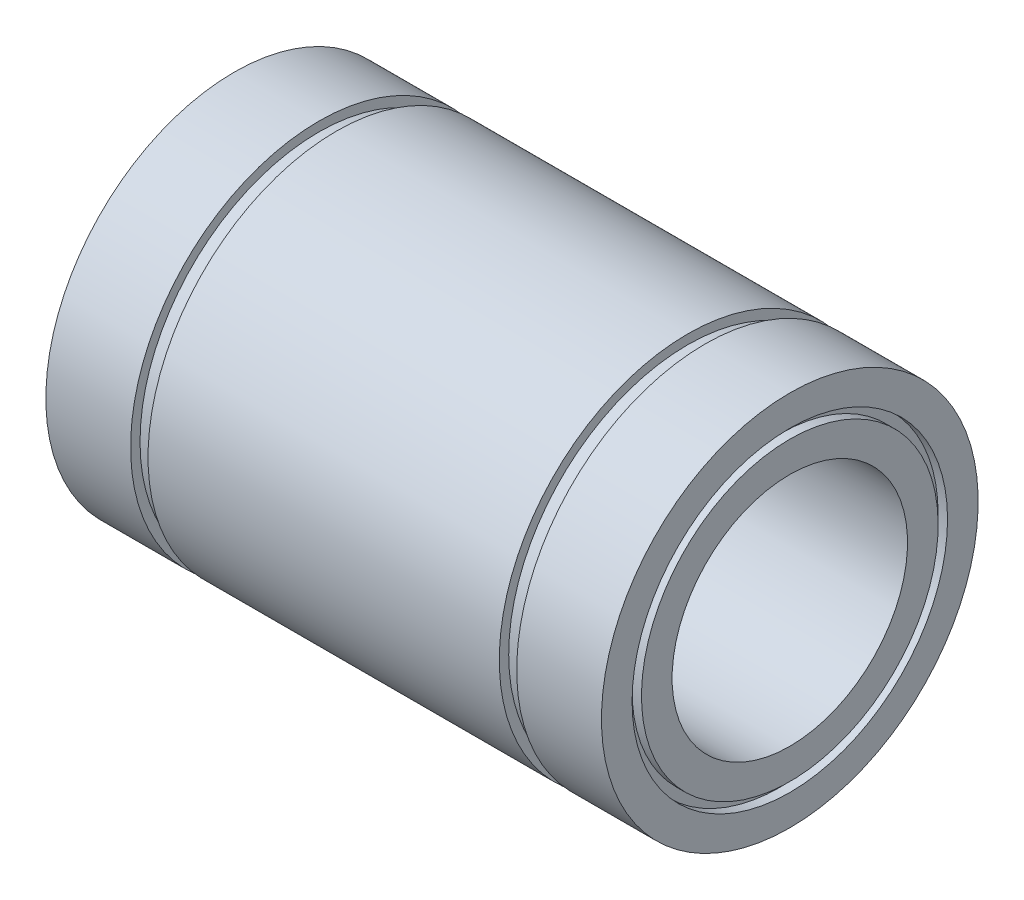
ISO-10303-21;
HEADER;
FILE_DESCRIPTION(('STEP AP214'),'2;1');
FILE_NAME('part.step','',(''),(''),'','','');
FILE_SCHEMA(('AUTOMOTIVE_DESIGN { 1 0 10303 214 1 1 1 1 }'));
ENDSEC;
DATA;
#1=APPLICATION_CONTEXT('core data for automotive mechanical design processes');
#2=APPLICATION_PROTOCOL_DEFINITION('international standard','automotive_design',2000,#1);
#3=PRODUCT_CONTEXT('',#1,'mechanical');
#4=PRODUCT('Part','Part','',(#3));
#5=PRODUCT_RELATED_PRODUCT_CATEGORY('part','',(#4));
#6=PRODUCT_DEFINITION_FORMATION('','',#4);
#7=PRODUCT_DEFINITION_CONTEXT('part definition',#1,'design');
#8=PRODUCT_DEFINITION('design','',#6,#7);
#9=PRODUCT_DEFINITION_SHAPE('','',#8);
#10=(LENGTH_UNIT() NAMED_UNIT(*) SI_UNIT(.MILLI.,.METRE.));
#11=(NAMED_UNIT(*) PLANE_ANGLE_UNIT() SI_UNIT($,.RADIAN.));
#12=(NAMED_UNIT(*) SI_UNIT($,.STERADIAN.) SOLID_ANGLE_UNIT());
#13=UNCERTAINTY_MEASURE_WITH_UNIT(LENGTH_MEASURE(1.E-05),#10,'distance_accuracy_value','');
#14=(GEOMETRIC_REPRESENTATION_CONTEXT(3) GLOBAL_UNCERTAINTY_ASSIGNED_CONTEXT((#13)) GLOBAL_UNIT_ASSIGNED_CONTEXT((#10,
#11,#12)) REPRESENTATION_CONTEXT('',''));
#15=CARTESIAN_POINT('',(0.,0.,0.));
#16=DIRECTION('',(0.,0.,1.));
#17=DIRECTION('',(1.,0.,0.));
#18=AXIS2_PLACEMENT_3D('',#15,#16,#17);
#19=CARTESIAN_POINT('',(-29.5,16.75,0.));
#20=DIRECTION('',(-1.,0.,0.));
#21=DIRECTION('',(0.,-1.,0.));
#22=AXIS2_PLACEMENT_3D('',#19,#20,#21);
#23=PLANE('',#22);
#24=CARTESIAN_POINT('',(-29.5,0.,0.));
#25=DIRECTION('',(1.,0.,0.));
#26=DIRECTION('',(0.,1.,0.));
#27=AXIS2_PLACEMENT_3D('',#24,#25,#26);
#28=CIRCLE('',#27,16.75);
#29=CARTESIAN_POINT('',(-29.5,16.75,0.));
#30=VERTEX_POINT('',#29);
#31=EDGE_CURVE('E122',#30,#30,#28,.T.);
#32=ORIENTED_EDGE('',*,*,#31,.T.);
#33=EDGE_LOOP('',(#32));
#34=FACE_BOUND('',#33,.T.);
#35=CARTESIAN_POINT('',(-29.5,0.,0.));
#36=DIRECTION('',(1.,0.,0.));
#37=DIRECTION('',(0.,1.,0.));
#38=AXIS2_PLACEMENT_3D('',#35,#36,#37);
#39=CIRCLE('',#38,20.);
#40=CARTESIAN_POINT('',(-29.5,20.,0.));
#41=VERTEX_POINT('',#40);
#42=EDGE_CURVE('E10',#41,#41,#39,.T.);
#43=ORIENTED_EDGE('',*,*,#42,.F.);
#44=EDGE_LOOP('',(#43));
#45=FACE_BOUND('',#44,.T.);
#46=ADVANCED_FACE('F38',(#34,#45),#23,.T.);
#47=CARTESIAN_POINT('',(0.,0.,0.));
#48=DIRECTION('',(1.,0.,0.));
#49=DIRECTION('',(0.,1.,0.));
#50=AXIS2_PLACEMENT_3D('',#47,#48,#49);
#51=CYLINDRICAL_SURFACE('',#50,20.);
#52=ORIENTED_EDGE('',*,*,#42,.T.);
#53=EDGE_LOOP('',(#52));
#54=FACE_BOUND('',#53,.T.);
#55=CARTESIAN_POINT('',(-20.5,0.,0.));
#56=DIRECTION('',(1.,0.,0.));
#57=DIRECTION('',(0.,1.,0.));
#58=AXIS2_PLACEMENT_3D('',#55,#56,#57);
#59=CIRCLE('',#58,20.);
#60=CARTESIAN_POINT('',(-20.5,20.,0.));
#61=VERTEX_POINT('',#60);
#62=EDGE_CURVE('E45',#61,#61,#59,.T.);
#63=ORIENTED_EDGE('',*,*,#62,.F.);
#64=EDGE_LOOP('',(#63));
#65=FACE_BOUND('',#64,.T.);
#66=ADVANCED_FACE('F140',(#54,#65),#51,.T.);
#67=CARTESIAN_POINT('',(-20.5,20.,0.));
#68=DIRECTION('',(1.,0.,0.));
#69=DIRECTION('',(0.,1.,0.));
#70=AXIS2_PLACEMENT_3D('',#67,#68,#69);
#71=PLANE('',#70);
#72=ORIENTED_EDGE('',*,*,#62,.T.);
#73=EDGE_LOOP('',(#72));
#74=FACE_BOUND('',#73,.T.);
#75=CARTESIAN_POINT('',(-20.5,0.,0.));
#76=DIRECTION('',(1.,0.,0.));
#77=DIRECTION('',(0.,1.,0.));
#78=AXIS2_PLACEMENT_3D('',#75,#76,#77);
#79=CIRCLE('',#78,19.);
#80=CARTESIAN_POINT('',(-20.5,19.,0.));
#81=VERTEX_POINT('',#80);
#82=EDGE_CURVE('E52',#81,#81,#79,.T.);
#83=ORIENTED_EDGE('',*,*,#82,.F.);
#84=EDGE_LOOP('',(#83));
#85=FACE_BOUND('',#84,.T.);
#86=ADVANCED_FACE('F144',(#74,#85),#71,.T.);
#87=CARTESIAN_POINT('',(0.,0.,0.));
#88=DIRECTION('',(1.,0.,0.));
#89=DIRECTION('',(0.,1.,0.));
#90=AXIS2_PLACEMENT_3D('',#87,#88,#89);
#91=CYLINDRICAL_SURFACE('',#90,19.);
#92=ORIENTED_EDGE('',*,*,#82,.T.);
#93=EDGE_LOOP('',(#92));
#94=FACE_BOUND('',#93,.T.);
#95=CARTESIAN_POINT('',(-18.65,0.,0.));
#96=DIRECTION('',(1.,0.,0.));
#97=DIRECTION('',(0.,1.,0.));
#98=AXIS2_PLACEMENT_3D('',#95,#96,#97);
#99=CIRCLE('',#98,19.);
#100=CARTESIAN_POINT('',(-18.65,19.,0.));
#101=VERTEX_POINT('',#100);
#102=EDGE_CURVE('E59',#101,#101,#99,.T.);
#103=ORIENTED_EDGE('',*,*,#102,.F.);
#104=EDGE_LOOP('',(#103));
#105=FACE_BOUND('',#104,.T.);
#106=ADVANCED_FACE('F148',(#94,#105),#91,.T.);
#107=CARTESIAN_POINT('',(-18.65,19.,0.));
#108=DIRECTION('',(-1.,0.,0.));
#109=DIRECTION('',(0.,-1.,0.));
#110=AXIS2_PLACEMENT_3D('',#107,#108,#109);
#111=PLANE('',#110);
#112=ORIENTED_EDGE('',*,*,#102,.T.);
#113=EDGE_LOOP('',(#112));
#114=FACE_BOUND('',#113,.T.);
#115=CARTESIAN_POINT('',(-18.65,0.,0.));
#116=DIRECTION('',(1.,0.,0.));
#117=DIRECTION('',(0.,1.,0.));
#118=AXIS2_PLACEMENT_3D('',#115,#116,#117);
#119=CIRCLE('',#118,20.);
#120=CARTESIAN_POINT('',(-18.65,20.,0.));
#121=VERTEX_POINT('',#120);
#122=EDGE_CURVE('E65',#121,#121,#119,.T.);
#123=ORIENTED_EDGE('',*,*,#122,.F.);
#124=EDGE_LOOP('',(#123));
#125=FACE_BOUND('',#124,.T.);
#126=ADVANCED_FACE('F154',(#114,#125),#111,.T.);
#127=CARTESIAN_POINT('',(0.,0.,0.));
#128=DIRECTION('',(1.,0.,0.));
#129=DIRECTION('',(0.,1.,0.));
#130=AXIS2_PLACEMENT_3D('',#127,#128,#129);
#131=CYLINDRICAL_SURFACE('',#130,20.);
#132=ORIENTED_EDGE('',*,*,#122,.T.);
#133=EDGE_LOOP('',(#132));
#134=FACE_BOUND('',#133,.T.);
#135=CARTESIAN_POINT('',(18.65,0.,0.));
#136=DIRECTION('',(1.,0.,0.));
#137=DIRECTION('',(0.,1.,0.));
#138=AXIS2_PLACEMENT_3D('',#135,#136,#137);
#139=CIRCLE('',#138,20.);
#140=CARTESIAN_POINT('',(18.65,20.,0.));
#141=VERTEX_POINT('',#140);
#142=EDGE_CURVE('E68',#141,#141,#139,.T.);
#143=ORIENTED_EDGE('',*,*,#142,.F.);
#144=EDGE_LOOP('',(#143));
#145=FACE_BOUND('',#144,.T.);
#146=ADVANCED_FACE('F158',(#134,#145),#131,.T.);
#147=CARTESIAN_POINT('',(18.65,20.,0.));
#148=DIRECTION('',(1.,0.,0.));
#149=DIRECTION('',(0.,1.,0.));
#150=AXIS2_PLACEMENT_3D('',#147,#148,#149);
#151=PLANE('',#150);
#152=ORIENTED_EDGE('',*,*,#142,.T.);
#153=EDGE_LOOP('',(#152));
#154=FACE_BOUND('',#153,.T.);
#155=CARTESIAN_POINT('',(18.65,0.,0.));
#156=DIRECTION('',(1.,0.,0.));
#157=DIRECTION('',(0.,1.,0.));
#158=AXIS2_PLACEMENT_3D('',#155,#156,#157);
#159=CIRCLE('',#158,19.);
#160=CARTESIAN_POINT('',(18.65,19.,0.));
#161=VERTEX_POINT('',#160);
#162=EDGE_CURVE('E72',#161,#161,#159,.T.);
#163=ORIENTED_EDGE('',*,*,#162,.F.);
#164=EDGE_LOOP('',(#163));
#165=FACE_BOUND('',#164,.T.);
#166=ADVANCED_FACE('F162',(#154,#165),#151,.T.);
#167=CARTESIAN_POINT('',(0.,0.,0.));
#168=DIRECTION('',(1.,0.,0.));
#169=DIRECTION('',(0.,1.,0.));
#170=AXIS2_PLACEMENT_3D('',#167,#168,#169);
#171=CYLINDRICAL_SURFACE('',#170,19.);
#172=ORIENTED_EDGE('',*,*,#162,.T.);
#173=EDGE_LOOP('',(#172));
#174=FACE_BOUND('',#173,.T.);
#175=CARTESIAN_POINT('',(20.5,0.,0.));
#176=DIRECTION('',(1.,0.,0.));
#177=DIRECTION('',(0.,1.,0.));
#178=AXIS2_PLACEMENT_3D('',#175,#176,#177);
#179=CIRCLE('',#178,19.);
#180=CARTESIAN_POINT('',(20.5,19.,0.));
#181=VERTEX_POINT('',#180);
#182=EDGE_CURVE('E76',#181,#181,#179,.T.);
#183=ORIENTED_EDGE('',*,*,#182,.F.);
#184=EDGE_LOOP('',(#183));
#185=FACE_BOUND('',#184,.T.);
#186=ADVANCED_FACE('F166',(#174,#185),#171,.T.);
#187=CARTESIAN_POINT('',(20.5,19.,0.));
#188=DIRECTION('',(-1.,0.,0.));
#189=DIRECTION('',(0.,-1.,0.));
#190=AXIS2_PLACEMENT_3D('',#187,#188,#189);
#191=PLANE('',#190);
#192=ORIENTED_EDGE('',*,*,#182,.T.);
#193=EDGE_LOOP('',(#192));
#194=FACE_BOUND('',#193,.T.);
#195=CARTESIAN_POINT('',(20.5,0.,0.));
#196=DIRECTION('',(1.,0.,0.));
#197=DIRECTION('',(0.,1.,0.));
#198=AXIS2_PLACEMENT_3D('',#195,#196,#197);
#199=CIRCLE('',#198,20.);
#200=CARTESIAN_POINT('',(20.5,20.,0.));
#201=VERTEX_POINT('',#200);
#202=EDGE_CURVE('E80',#201,#201,#199,.T.);
#203=ORIENTED_EDGE('',*,*,#202,.F.);
#204=EDGE_LOOP('',(#203));
#205=FACE_BOUND('',#204,.T.);
#206=ADVANCED_FACE('F170',(#194,#205),#191,.T.);
#207=CARTESIAN_POINT('',(0.,0.,0.));
#208=DIRECTION('',(1.,0.,0.));
#209=DIRECTION('',(0.,1.,0.));
#210=AXIS2_PLACEMENT_3D('',#207,#208,#209);
#211=CYLINDRICAL_SURFACE('',#210,20.);
#212=ORIENTED_EDGE('',*,*,#202,.T.);
#213=EDGE_LOOP('',(#212));
#214=FACE_BOUND('',#213,.T.);
#215=CARTESIAN_POINT('',(29.5,0.,0.));
#216=DIRECTION('',(1.,0.,0.));
#217=DIRECTION('',(0.,1.,0.));
#218=AXIS2_PLACEMENT_3D('',#215,#216,#217);
#219=CIRCLE('',#218,20.);
#220=CARTESIAN_POINT('',(29.5,20.,0.));
#221=VERTEX_POINT('',#220);
#222=EDGE_CURVE('E84',#221,#221,#219,.T.);
#223=ORIENTED_EDGE('',*,*,#222,.F.);
#224=EDGE_LOOP('',(#223));
#225=FACE_BOUND('',#224,.T.);
#226=ADVANCED_FACE('F174',(#214,#225),#211,.T.);
#227=CARTESIAN_POINT('',(29.5,20.,0.));
#228=DIRECTION('',(1.,0.,0.));
#229=DIRECTION('',(0.,1.,0.));
#230=AXIS2_PLACEMENT_3D('',#227,#228,#229);
#231=PLANE('',#230);
#232=ORIENTED_EDGE('',*,*,#222,.T.);
#233=EDGE_LOOP('',(#232));
#234=FACE_BOUND('',#233,.T.);
#235=CARTESIAN_POINT('',(29.5,0.,0.));
#236=DIRECTION('',(1.,0.,0.));
#237=DIRECTION('',(0.,1.,0.));
#238=AXIS2_PLACEMENT_3D('',#235,#236,#237);
#239=CIRCLE('',#238,16.75);
#240=CARTESIAN_POINT('',(29.5,16.75,0.));
#241=VERTEX_POINT('',#240);
#242=EDGE_CURVE('E88',#241,#241,#239,.T.);
#243=ORIENTED_EDGE('',*,*,#242,.F.);
#244=EDGE_LOOP('',(#243));
#245=FACE_BOUND('',#244,.T.);
#246=ADVANCED_FACE('F178',(#234,#245),#231,.T.);
#247=CARTESIAN_POINT('',(0.,0.,0.));
#248=DIRECTION('',(1.,0.,0.));
#249=DIRECTION('',(0.,1.,0.));
#250=AXIS2_PLACEMENT_3D('',#247,#248,#249);
#251=CYLINDRICAL_SURFACE('',#250,16.75);
#252=ORIENTED_EDGE('',*,*,#242,.T.);
#253=EDGE_LOOP('',(#252));
#254=FACE_BOUND('',#253,.T.);
#255=CARTESIAN_POINT('',(28.5,0.,0.));
#256=DIRECTION('',(1.,0.,0.));
#257=DIRECTION('',(0.,1.,0.));
#258=AXIS2_PLACEMENT_3D('',#255,#256,#257);
#259=CIRCLE('',#258,16.75);
#260=CARTESIAN_POINT('',(28.5,16.75,0.));
#261=VERTEX_POINT('',#260);
#262=EDGE_CURVE('E92',#261,#261,#259,.T.);
#263=ORIENTED_EDGE('',*,*,#262,.F.);
#264=EDGE_LOOP('',(#263));
#265=FACE_BOUND('',#264,.T.);
#266=ADVANCED_FACE('F182',(#254,#265),#251,.F.);
#267=CARTESIAN_POINT('',(28.5,16.75,0.));
#268=DIRECTION('',(1.,0.,0.));
#269=DIRECTION('',(0.,1.,0.));
#270=AXIS2_PLACEMENT_3D('',#267,#268,#269);
#271=PLANE('',#270);
#272=ORIENTED_EDGE('',*,*,#262,.T.);
#273=EDGE_LOOP('',(#272));
#274=FACE_BOUND('',#273,.T.);
#275=CARTESIAN_POINT('',(28.5,0.,0.));
#276=DIRECTION('',(1.,0.,0.));
#277=DIRECTION('',(0.,1.,0.));
#278=AXIS2_PLACEMENT_3D('',#275,#276,#277);
#279=CIRCLE('',#278,15.75);
#280=CARTESIAN_POINT('',(28.5,15.75,0.));
#281=VERTEX_POINT('',#280);
#282=EDGE_CURVE('E96',#281,#281,#279,.T.);
#283=ORIENTED_EDGE('',*,*,#282,.F.);
#284=EDGE_LOOP('',(#283));
#285=FACE_BOUND('',#284,.T.);
#286=ADVANCED_FACE('F186',(#274,#285),#271,.T.);
#287=CARTESIAN_POINT('',(0.,0.,0.));
#288=DIRECTION('',(1.,0.,0.));
#289=DIRECTION('',(0.,1.,0.));
#290=AXIS2_PLACEMENT_3D('',#287,#288,#289);
#291=CYLINDRICAL_SURFACE('',#290,15.75);
#292=ORIENTED_EDGE('',*,*,#282,.T.);
#293=EDGE_LOOP('',(#292));
#294=FACE_BOUND('',#293,.T.);
#295=CARTESIAN_POINT('',(29.5,0.,0.));
#296=DIRECTION('',(1.,0.,0.));
#297=DIRECTION('',(0.,1.,0.));
#298=AXIS2_PLACEMENT_3D('',#295,#296,#297);
#299=CIRCLE('',#298,15.75);
#300=CARTESIAN_POINT('',(29.5,15.75,0.));
#301=VERTEX_POINT('',#300);
#302=EDGE_CURVE('E99',#301,#301,#299,.T.);
#303=ORIENTED_EDGE('',*,*,#302,.F.);
#304=EDGE_LOOP('',(#303));
#305=FACE_BOUND('',#304,.T.);
#306=ADVANCED_FACE('F190',(#294,#305),#291,.T.);
#307=CARTESIAN_POINT('',(29.5,15.75,0.));
#308=DIRECTION('',(1.,0.,0.));
#309=DIRECTION('',(0.,1.,0.));
#310=AXIS2_PLACEMENT_3D('',#307,#308,#309);
#311=PLANE('',#310);
#312=ORIENTED_EDGE('',*,*,#302,.T.);
#313=EDGE_LOOP('',(#312));
#314=FACE_BOUND('',#313,.T.);
#315=CARTESIAN_POINT('',(29.5,0.,0.));
#316=DIRECTION('',(1.,0.,0.));
#317=DIRECTION('',(0.,1.,0.));
#318=AXIS2_PLACEMENT_3D('',#315,#316,#317);
#319=CIRCLE('',#318,12.5);
#320=CARTESIAN_POINT('',(29.5,12.5,0.));
#321=VERTEX_POINT('',#320);
#322=EDGE_CURVE('E103',#321,#321,#319,.T.);
#323=ORIENTED_EDGE('',*,*,#322,.F.);
#324=EDGE_LOOP('',(#323));
#325=FACE_BOUND('',#324,.T.);
#326=ADVANCED_FACE('F194',(#314,#325),#311,.T.);
#327=CARTESIAN_POINT('',(0.,0.,0.));
#328=DIRECTION('',(1.,0.,0.));
#329=DIRECTION('',(0.,1.,0.));
#330=AXIS2_PLACEMENT_3D('',#327,#328,#329);
#331=CYLINDRICAL_SURFACE('',#330,12.5);
#332=ORIENTED_EDGE('',*,*,#322,.T.);
#333=EDGE_LOOP('',(#332));
#334=FACE_BOUND('',#333,.T.);
#335=CARTESIAN_POINT('',(-29.5,0.,0.));
#336=DIRECTION('',(1.,0.,0.));
#337=DIRECTION('',(0.,1.,0.));
#338=AXIS2_PLACEMENT_3D('',#335,#336,#337);
#339=CIRCLE('',#338,12.5);
#340=CARTESIAN_POINT('',(-29.5,12.5,0.));
#341=VERTEX_POINT('',#340);
#342=EDGE_CURVE('E106',#341,#341,#339,.T.);
#343=ORIENTED_EDGE('',*,*,#342,.F.);
#344=EDGE_LOOP('',(#343));
#345=FACE_BOUND('',#344,.T.);
#346=ADVANCED_FACE('F198',(#334,#345),#331,.F.);
#347=CARTESIAN_POINT('',(-29.5,12.5,0.));
#348=DIRECTION('',(-1.,0.,0.));
#349=DIRECTION('',(0.,-1.,0.));
#350=AXIS2_PLACEMENT_3D('',#347,#348,#349);
#351=PLANE('',#350);
#352=ORIENTED_EDGE('',*,*,#342,.T.);
#353=EDGE_LOOP('',(#352));
#354=FACE_BOUND('',#353,.T.);
#355=CARTESIAN_POINT('',(-29.5,0.,0.));
#356=DIRECTION('',(1.,0.,0.));
#357=DIRECTION('',(0.,1.,0.));
#358=AXIS2_PLACEMENT_3D('',#355,#356,#357);
#359=CIRCLE('',#358,15.75);
#360=CARTESIAN_POINT('',(-29.5,15.75,0.));
#361=VERTEX_POINT('',#360);
#362=EDGE_CURVE('E110',#361,#361,#359,.T.);
#363=ORIENTED_EDGE('',*,*,#362,.F.);
#364=EDGE_LOOP('',(#363));
#365=FACE_BOUND('',#364,.T.);
#366=ADVANCED_FACE('F202',(#354,#365),#351,.T.);
#367=CARTESIAN_POINT('',(0.,0.,0.));
#368=DIRECTION('',(1.,0.,0.));
#369=DIRECTION('',(0.,1.,0.));
#370=AXIS2_PLACEMENT_3D('',#367,#368,#369);
#371=CYLINDRICAL_SURFACE('',#370,15.75);
#372=ORIENTED_EDGE('',*,*,#362,.T.);
#373=EDGE_LOOP('',(#372));
#374=FACE_BOUND('',#373,.T.);
#375=CARTESIAN_POINT('',(-28.5,0.,0.));
#376=DIRECTION('',(1.,0.,0.));
#377=DIRECTION('',(0.,1.,0.));
#378=AXIS2_PLACEMENT_3D('',#375,#376,#377);
#379=CIRCLE('',#378,15.75);
#380=CARTESIAN_POINT('',(-28.5,15.75,0.));
#381=VERTEX_POINT('',#380);
#382=EDGE_CURVE('E114',#381,#381,#379,.T.);
#383=ORIENTED_EDGE('',*,*,#382,.F.);
#384=EDGE_LOOP('',(#383));
#385=FACE_BOUND('',#384,.T.);
#386=ADVANCED_FACE('F136',(#374,#385),#371,.T.);
#387=CARTESIAN_POINT('',(-28.5,16.75,0.));
#388=DIRECTION('',(-1.,0.,0.));
#389=DIRECTION('',(0.,-1.,0.));
#390=AXIS2_PLACEMENT_3D('',#387,#388,#389);
#391=PLANE('',#390);
#392=ORIENTED_EDGE('',*,*,#382,.T.);
#393=EDGE_LOOP('',(#392));
#394=FACE_BOUND('',#393,.T.);
#395=CARTESIAN_POINT('',(-28.5,0.,0.));
#396=DIRECTION('',(1.,0.,0.));
#397=DIRECTION('',(0.,1.,0.));
#398=AXIS2_PLACEMENT_3D('',#395,#396,#397);
#399=CIRCLE('',#398,16.75);
#400=CARTESIAN_POINT('',(-28.5,16.75,0.));
#401=VERTEX_POINT('',#400);
#402=EDGE_CURVE('E118',#401,#401,#399,.T.);
#403=ORIENTED_EDGE('',*,*,#402,.F.);
#404=EDGE_LOOP('',(#403));
#405=FACE_BOUND('',#404,.T.);
#406=ADVANCED_FACE('F130',(#394,#405),#391,.T.);
#407=CARTESIAN_POINT('',(0.,0.,0.));
#408=DIRECTION('',(1.,0.,0.));
#409=DIRECTION('',(0.,1.,0.));
#410=AXIS2_PLACEMENT_3D('',#407,#408,#409);
#411=CYLINDRICAL_SURFACE('',#410,16.75);
#412=ORIENTED_EDGE('',*,*,#402,.T.);
#413=EDGE_LOOP('',(#412));
#414=FACE_BOUND('',#413,.T.);
#415=ORIENTED_EDGE('',*,*,#31,.F.);
#416=EDGE_LOOP('',(#415));
#417=FACE_BOUND('',#416,.T.);
#418=ADVANCED_FACE('F128',(#414,#417),#411,.F.);
#419=CLOSED_SHELL('',(#46,#66,#86,#106,#126,#146,#166,#186,#206,#226,#246,#266,#286,#306,#326,
#346,#366,#386,#406,#418));
#420=MANIFOLD_SOLID_BREP('B2',#419);
#421=ADVANCED_BREP_SHAPE_REPRESENTATION('',(#18,#420),#14);
#422=SHAPE_DEFINITION_REPRESENTATION(#9,#421);
ENDSEC;
END-ISO-10303-21;
